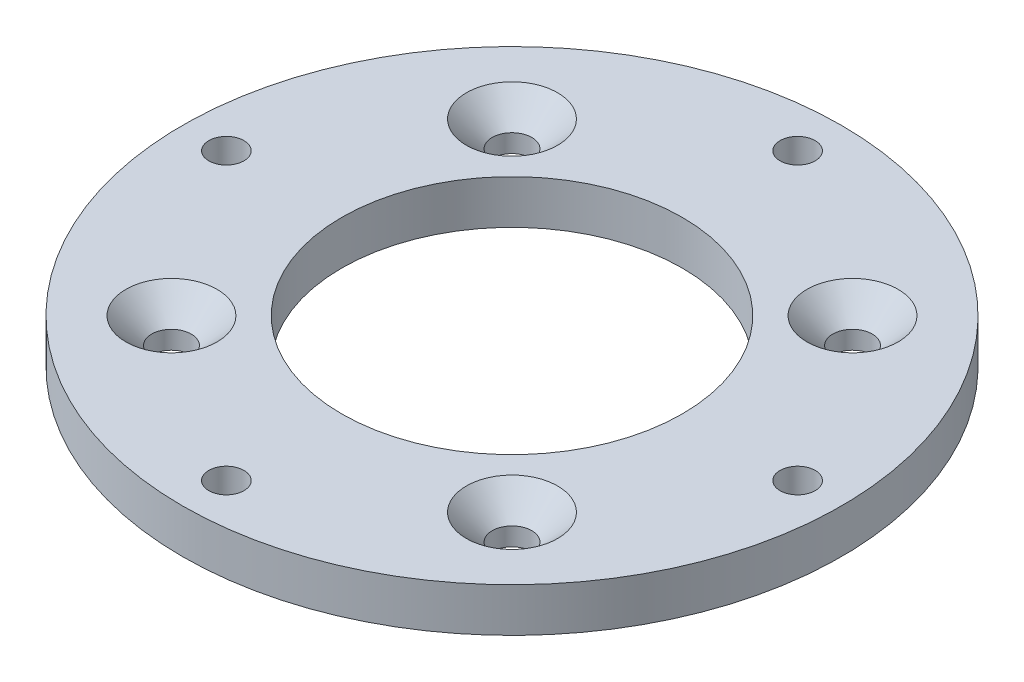
ISO-10303-21;
HEADER;
FILE_DESCRIPTION(('STEP AP214'),'2;1');
FILE_NAME('part.step','',(''),(''),'','','');
FILE_SCHEMA(('AUTOMOTIVE_DESIGN { 1 0 10303 214 1 1 1 1 }'));
ENDSEC;
DATA;
#1=APPLICATION_CONTEXT('core data for automotive mechanical design processes');
#2=APPLICATION_PROTOCOL_DEFINITION('international standard','automotive_design',2000,#1);
#3=PRODUCT_CONTEXT('',#1,'mechanical');
#4=PRODUCT('Part','Part','',(#3));
#5=PRODUCT_RELATED_PRODUCT_CATEGORY('part','',(#4));
#6=PRODUCT_DEFINITION_FORMATION('','',#4);
#7=PRODUCT_DEFINITION_CONTEXT('part definition',#1,'design');
#8=PRODUCT_DEFINITION('design','',#6,#7);
#9=PRODUCT_DEFINITION_SHAPE('','',#8);
#10=(LENGTH_UNIT() NAMED_UNIT(*) SI_UNIT(.MILLI.,.METRE.));
#11=(NAMED_UNIT(*) PLANE_ANGLE_UNIT() SI_UNIT($,.RADIAN.));
#12=(NAMED_UNIT(*) SI_UNIT($,.STERADIAN.) SOLID_ANGLE_UNIT());
#13=UNCERTAINTY_MEASURE_WITH_UNIT(LENGTH_MEASURE(1.E-05),#10,'distance_accuracy_value','');
#14=(GEOMETRIC_REPRESENTATION_CONTEXT(3) GLOBAL_UNCERTAINTY_ASSIGNED_CONTEXT((#13)) GLOBAL_UNIT_ASSIGNED_CONTEXT((#10,
#11,#12)) REPRESENTATION_CONTEXT('',''));
#15=CARTESIAN_POINT('',(0.,0.,0.));
#16=DIRECTION('',(0.,0.,1.));
#17=DIRECTION('',(1.,0.,0.));
#18=AXIS2_PLACEMENT_3D('',#15,#16,#17);
#19=CARTESIAN_POINT('',(0.,-4.,0.));
#20=DIRECTION('',(0.,1.,0.));
#21=DIRECTION('',(0.,0.,1.));
#22=AXIS2_PLACEMENT_3D('',#19,#20,#21);
#23=CYLINDRICAL_SURFACE('',#22,30.);
#24=CARTESIAN_POINT('',(0.,-4.,0.));
#25=DIRECTION('',(0.,1.,0.));
#26=DIRECTION('',(0.,0.,1.));
#27=AXIS2_PLACEMENT_3D('',#24,#25,#26);
#28=CIRCLE('',#27,30.);
#29=CARTESIAN_POINT('',(0.,-4.,30.));
#30=VERTEX_POINT('',#29);
#31=EDGE_CURVE('E10',#30,#30,#28,.T.);
#32=ORIENTED_EDGE('',*,*,#31,.T.);
#33=EDGE_LOOP('',(#32));
#34=FACE_BOUND('',#33,.T.);
#35=CARTESIAN_POINT('',(0.,0.,0.));
#36=DIRECTION('',(0.,1.,0.));
#37=DIRECTION('',(0.,0.,1.));
#38=AXIS2_PLACEMENT_3D('',#35,#36,#37);
#39=CIRCLE('',#38,30.);
#40=CARTESIAN_POINT('',(0.,0.,30.));
#41=VERTEX_POINT('',#40);
#42=EDGE_CURVE('E48',#41,#41,#39,.T.);
#43=ORIENTED_EDGE('',*,*,#42,.F.);
#44=EDGE_LOOP('',(#43));
#45=FACE_BOUND('',#44,.T.);
#46=ADVANCED_FACE('F41',(#34,#45),#23,.T.);
#47=CARTESIAN_POINT('',(0.,-4.,0.));
#48=DIRECTION('',(0.,1.,0.));
#49=DIRECTION('',(0.,0.,1.));
#50=AXIS2_PLACEMENT_3D('',#47,#48,#49);
#51=PLANE('',#50);
#52=CARTESIAN_POINT('',(0.,-4.,26.));
#53=DIRECTION('',(0.,-1.,0.));
#54=DIRECTION('',(0.,0.,-1.));
#55=AXIS2_PLACEMENT_3D('',#52,#53,#54);
#56=CIRCLE('',#55,3.15);
#57=CARTESIAN_POINT('',(0.,-4.,22.85));
#58=VERTEX_POINT('',#57);
#59=EDGE_CURVE('E126',#58,#58,#56,.T.);
#60=ORIENTED_EDGE('',*,*,#59,.F.);
#61=EDGE_LOOP('',(#60));
#62=FACE_BOUND('',#61,.T.);
#63=CARTESIAN_POINT('',(26.,-4.,0.));
#64=DIRECTION('',(0.,-1.,0.));
#65=DIRECTION('',(0.,0.,-1.));
#66=AXIS2_PLACEMENT_3D('',#63,#64,#65);
#67=CIRCLE('',#66,3.15);
#68=CARTESIAN_POINT('',(26.,-4.,-3.15));
#69=VERTEX_POINT('',#68);
#70=EDGE_CURVE('E117',#69,#69,#67,.T.);
#71=ORIENTED_EDGE('',*,*,#70,.F.);
#72=EDGE_LOOP('',(#71));
#73=FACE_BOUND('',#72,.T.);
#74=CARTESIAN_POINT('',(0.,-4.,-26.));
#75=DIRECTION('',(0.,-1.,0.));
#76=DIRECTION('',(0.,0.,-1.));
#77=AXIS2_PLACEMENT_3D('',#74,#75,#76);
#78=CIRCLE('',#77,3.15);
#79=CARTESIAN_POINT('',(0.,-4.,-29.15));
#80=VERTEX_POINT('',#79);
#81=EDGE_CURVE('E108',#80,#80,#78,.T.);
#82=ORIENTED_EDGE('',*,*,#81,.F.);
#83=EDGE_LOOP('',(#82));
#84=FACE_BOUND('',#83,.T.);
#85=CARTESIAN_POINT('',(-26.,-4.,0.));
#86=DIRECTION('',(0.,-1.,0.));
#87=DIRECTION('',(0.,0.,-1.));
#88=AXIS2_PLACEMENT_3D('',#85,#86,#87);
#89=CIRCLE('',#88,3.15);
#90=CARTESIAN_POINT('',(-26.,-4.,-3.15));
#91=VERTEX_POINT('',#90);
#92=EDGE_CURVE('E99',#91,#91,#89,.T.);
#93=ORIENTED_EDGE('',*,*,#92,.F.);
#94=EDGE_LOOP('',(#93));
#95=FACE_BOUND('',#94,.T.);
#96=CARTESIAN_POINT('',(15.5,-4.,-15.5));
#97=DIRECTION('',(0.,1.,0.));
#98=DIRECTION('',(0.,0.,1.));
#99=AXIS2_PLACEMENT_3D('',#96,#97,#98);
#100=CIRCLE('',#99,1.8);
#101=CARTESIAN_POINT('',(15.5,-4.,-13.7));
#102=VERTEX_POINT('',#101);
#103=EDGE_CURVE('E84',#102,#102,#100,.T.);
#104=ORIENTED_EDGE('',*,*,#103,.T.);
#105=EDGE_LOOP('',(#104));
#106=FACE_BOUND('',#105,.T.);
#107=CARTESIAN_POINT('',(-15.5,-4.,-15.5));
#108=DIRECTION('',(0.,1.,0.));
#109=DIRECTION('',(0.,0.,1.));
#110=AXIS2_PLACEMENT_3D('',#107,#108,#109);
#111=CIRCLE('',#110,1.8);
#112=CARTESIAN_POINT('',(-15.5,-4.,-13.7));
#113=VERTEX_POINT('',#112);
#114=EDGE_CURVE('E75',#113,#113,#111,.T.);
#115=ORIENTED_EDGE('',*,*,#114,.T.);
#116=EDGE_LOOP('',(#115));
#117=FACE_BOUND('',#116,.T.);
#118=CARTESIAN_POINT('',(-15.5,-4.,15.5));
#119=DIRECTION('',(0.,1.,0.));
#120=DIRECTION('',(0.,0.,1.));
#121=AXIS2_PLACEMENT_3D('',#118,#119,#120);
#122=CIRCLE('',#121,1.8);
#123=CARTESIAN_POINT('',(-15.5,-4.,17.3));
#124=VERTEX_POINT('',#123);
#125=EDGE_CURVE('E66',#124,#124,#122,.T.);
#126=ORIENTED_EDGE('',*,*,#125,.T.);
#127=EDGE_LOOP('',(#126));
#128=FACE_BOUND('',#127,.T.);
#129=CARTESIAN_POINT('',(15.5,-4.,15.5));
#130=DIRECTION('',(0.,1.,0.));
#131=DIRECTION('',(0.,0.,1.));
#132=AXIS2_PLACEMENT_3D('',#129,#130,#131);
#133=CIRCLE('',#132,1.8);
#134=CARTESIAN_POINT('',(15.5,-4.,17.3));
#135=VERTEX_POINT('',#134);
#136=EDGE_CURVE('E57',#135,#135,#133,.T.);
#137=ORIENTED_EDGE('',*,*,#136,.T.);
#138=EDGE_LOOP('',(#137));
#139=FACE_BOUND('',#138,.T.);
#140=CARTESIAN_POINT('',(0.,-4.,0.));
#141=DIRECTION('',(0.,-1.,0.));
#142=DIRECTION('',(0.,0.,-1.));
#143=AXIS2_PLACEMENT_3D('',#140,#141,#142);
#144=CIRCLE('',#143,15.5);
#145=CARTESIAN_POINT('',(0.,-4.,-15.5));
#146=VERTEX_POINT('',#145);
#147=EDGE_CURVE('E54',#146,#146,#144,.T.);
#148=ORIENTED_EDGE('',*,*,#147,.F.);
#149=EDGE_LOOP('',(#148));
#150=FACE_BOUND('',#149,.T.);
#151=ORIENTED_EDGE('',*,*,#31,.F.);
#152=EDGE_LOOP('',(#151));
#153=FACE_BOUND('',#152,.T.);
#154=ADVANCED_FACE('F132',(#62,#73,#84,#95,#106,#117,#128,#139,#150,#153),#51,.F.);
#155=CARTESIAN_POINT('',(0.,0.,0.));
#156=DIRECTION('',(0.,1.,0.));
#157=DIRECTION('',(0.,0.,1.));
#158=AXIS2_PLACEMENT_3D('',#155,#156,#157);
#159=PLANE('',#158);
#160=CARTESIAN_POINT('',(0.,0.,26.));
#161=DIRECTION('',(0.,-1.,0.));
#162=DIRECTION('',(0.,0.,-1.));
#163=AXIS2_PLACEMENT_3D('',#160,#161,#162);
#164=CIRCLE('',#163,1.6);
#165=CARTESIAN_POINT('',(0.,0.,24.4));
#166=VERTEX_POINT('',#165);
#167=EDGE_CURVE('E120',#166,#166,#164,.T.);
#168=ORIENTED_EDGE('',*,*,#167,.T.);
#169=EDGE_LOOP('',(#168));
#170=FACE_BOUND('',#169,.T.);
#171=CARTESIAN_POINT('',(26.,0.,0.));
#172=DIRECTION('',(0.,-1.,0.));
#173=DIRECTION('',(0.,0.,-1.));
#174=AXIS2_PLACEMENT_3D('',#171,#172,#173);
#175=CIRCLE('',#174,1.6);
#176=CARTESIAN_POINT('',(26.,0.,-1.6));
#177=VERTEX_POINT('',#176);
#178=EDGE_CURVE('E111',#177,#177,#175,.T.);
#179=ORIENTED_EDGE('',*,*,#178,.T.);
#180=EDGE_LOOP('',(#179));
#181=FACE_BOUND('',#180,.T.);
#182=CARTESIAN_POINT('',(0.,0.,-26.));
#183=DIRECTION('',(0.,-1.,0.));
#184=DIRECTION('',(0.,0.,-1.));
#185=AXIS2_PLACEMENT_3D('',#182,#183,#184);
#186=CIRCLE('',#185,1.6);
#187=CARTESIAN_POINT('',(0.,0.,-27.6));
#188=VERTEX_POINT('',#187);
#189=EDGE_CURVE('E102',#188,#188,#186,.T.);
#190=ORIENTED_EDGE('',*,*,#189,.T.);
#191=EDGE_LOOP('',(#190));
#192=FACE_BOUND('',#191,.T.);
#193=CARTESIAN_POINT('',(-26.,0.,0.));
#194=DIRECTION('',(0.,-1.,0.));
#195=DIRECTION('',(0.,0.,-1.));
#196=AXIS2_PLACEMENT_3D('',#193,#194,#195);
#197=CIRCLE('',#196,1.6);
#198=CARTESIAN_POINT('',(-26.,0.,-1.6));
#199=VERTEX_POINT('',#198);
#200=EDGE_CURVE('E93',#199,#199,#197,.T.);
#201=ORIENTED_EDGE('',*,*,#200,.T.);
#202=EDGE_LOOP('',(#201));
#203=FACE_BOUND('',#202,.T.);
#204=CARTESIAN_POINT('',(15.5,0.,-15.5));
#205=DIRECTION('',(0.,1.,0.));
#206=DIRECTION('',(0.,0.,1.));
#207=AXIS2_PLACEMENT_3D('',#204,#205,#206);
#208=CIRCLE('',#207,4.15);
#209=CARTESIAN_POINT('',(15.5,0.,-11.35));
#210=VERTEX_POINT('',#209);
#211=EDGE_CURVE('E90',#210,#210,#208,.T.);
#212=ORIENTED_EDGE('',*,*,#211,.F.);
#213=EDGE_LOOP('',(#212));
#214=FACE_BOUND('',#213,.T.);
#215=CARTESIAN_POINT('',(-15.5,0.,-15.5));
#216=DIRECTION('',(0.,1.,0.));
#217=DIRECTION('',(0.,0.,1.));
#218=AXIS2_PLACEMENT_3D('',#215,#216,#217);
#219=CIRCLE('',#218,4.15);
#220=CARTESIAN_POINT('',(-15.5,0.,-11.35));
#221=VERTEX_POINT('',#220);
#222=EDGE_CURVE('E81',#221,#221,#219,.T.);
#223=ORIENTED_EDGE('',*,*,#222,.F.);
#224=EDGE_LOOP('',(#223));
#225=FACE_BOUND('',#224,.T.);
#226=CARTESIAN_POINT('',(-15.5,0.,15.5));
#227=DIRECTION('',(0.,1.,0.));
#228=DIRECTION('',(0.,0.,1.));
#229=AXIS2_PLACEMENT_3D('',#226,#227,#228);
#230=CIRCLE('',#229,4.15);
#231=CARTESIAN_POINT('',(-15.5,0.,19.65));
#232=VERTEX_POINT('',#231);
#233=EDGE_CURVE('E72',#232,#232,#230,.T.);
#234=ORIENTED_EDGE('',*,*,#233,.F.);
#235=EDGE_LOOP('',(#234));
#236=FACE_BOUND('',#235,.T.);
#237=CARTESIAN_POINT('',(15.5,0.,15.5));
#238=DIRECTION('',(0.,1.,0.));
#239=DIRECTION('',(0.,0.,1.));
#240=AXIS2_PLACEMENT_3D('',#237,#238,#239);
#241=CIRCLE('',#240,4.15);
#242=CARTESIAN_POINT('',(15.5,0.,19.65));
#243=VERTEX_POINT('',#242);
#244=EDGE_CURVE('E63',#243,#243,#241,.T.);
#245=ORIENTED_EDGE('',*,*,#244,.F.);
#246=EDGE_LOOP('',(#245));
#247=FACE_BOUND('',#246,.T.);
#248=CARTESIAN_POINT('',(0.,0.,0.));
#249=DIRECTION('',(0.,1.,0.));
#250=DIRECTION('',(0.,0.,1.));
#251=AXIS2_PLACEMENT_3D('',#248,#249,#250);
#252=CIRCLE('',#251,15.5);
#253=CARTESIAN_POINT('',(0.,0.,15.5));
#254=VERTEX_POINT('',#253);
#255=EDGE_CURVE('E44',#254,#254,#252,.T.);
#256=ORIENTED_EDGE('',*,*,#255,.F.);
#257=EDGE_LOOP('',(#256));
#258=FACE_BOUND('',#257,.T.);
#259=ORIENTED_EDGE('',*,*,#42,.T.);
#260=EDGE_LOOP('',(#259));
#261=FACE_BOUND('',#260,.T.);
#262=ADVANCED_FACE('F135',(#170,#181,#192,#203,#214,#225,#236,#247,#258,#261),#159,.T.);
#263=CARTESIAN_POINT('',(0.,2.,0.));
#264=DIRECTION('',(0.,-1.,0.));
#265=DIRECTION('',(0.,0.,-1.));
#266=AXIS2_PLACEMENT_3D('',#263,#264,#265);
#267=CYLINDRICAL_SURFACE('',#266,15.5);
#268=ORIENTED_EDGE('',*,*,#255,.T.);
#269=EDGE_LOOP('',(#268));
#270=FACE_BOUND('',#269,.T.);
#271=ORIENTED_EDGE('',*,*,#147,.T.);
#272=EDGE_LOOP('',(#271));
#273=FACE_BOUND('',#272,.T.);
#274=ADVANCED_FACE('F154',(#270,#273),#267,.F.);
#275=CARTESIAN_POINT('',(15.5,0.,15.5));
#276=DIRECTION('',(0.,1.,0.));
#277=DIRECTION('',(0.,0.,1.));
#278=AXIS2_PLACEMENT_3D('',#275,#276,#277);
#279=CYLINDRICAL_SURFACE('',#278,1.8);
#280=ORIENTED_EDGE('',*,*,#136,.F.);
#281=EDGE_LOOP('',(#280));
#282=FACE_BOUND('',#281,.T.);
#283=CARTESIAN_POINT('',(15.5,-2.35,15.5));
#284=DIRECTION('',(0.,1.,0.));
#285=DIRECTION('',(0.,0.,1.));
#286=AXIS2_PLACEMENT_3D('',#283,#284,#285);
#287=CIRCLE('',#286,1.8);
#288=CARTESIAN_POINT('',(15.5,-2.35,17.3));
#289=VERTEX_POINT('',#288);
#290=EDGE_CURVE('E60',#289,#289,#287,.T.);
#291=ORIENTED_EDGE('',*,*,#290,.T.);
#292=EDGE_LOOP('',(#291));
#293=FACE_BOUND('',#292,.T.);
#294=ADVANCED_FACE('F156',(#282,#293),#279,.F.);
#295=CARTESIAN_POINT('',(15.5,0.,15.5));
#296=DIRECTION('',(0.,1.,0.));
#297=DIRECTION('',(0.,0.,1.));
#298=AXIS2_PLACEMENT_3D('',#295,#296,#297);
#299=CONICAL_SURFACE('',#298,4.15,0.785398163397448);
#300=ORIENTED_EDGE('',*,*,#290,.F.);
#301=EDGE_LOOP('',(#300));
#302=FACE_BOUND('',#301,.T.);
#303=ORIENTED_EDGE('',*,*,#244,.T.);
#304=EDGE_LOOP('',(#303));
#305=FACE_BOUND('',#304,.T.);
#306=ADVANCED_FACE('F163',(#302,#305),#299,.F.);
#307=CARTESIAN_POINT('',(-15.5,0.,15.5));
#308=DIRECTION('',(0.,1.,0.));
#309=DIRECTION('',(0.,0.,1.));
#310=AXIS2_PLACEMENT_3D('',#307,#308,#309);
#311=CYLINDRICAL_SURFACE('',#310,1.8);
#312=ORIENTED_EDGE('',*,*,#125,.F.);
#313=EDGE_LOOP('',(#312));
#314=FACE_BOUND('',#313,.T.);
#315=CARTESIAN_POINT('',(-15.5,-2.35,15.5));
#316=DIRECTION('',(0.,1.,0.));
#317=DIRECTION('',(0.,0.,1.));
#318=AXIS2_PLACEMENT_3D('',#315,#316,#317);
#319=CIRCLE('',#318,1.8);
#320=CARTESIAN_POINT('',(-15.5,-2.35,17.3));
#321=VERTEX_POINT('',#320);
#322=EDGE_CURVE('E69',#321,#321,#319,.T.);
#323=ORIENTED_EDGE('',*,*,#322,.T.);
#324=EDGE_LOOP('',(#323));
#325=FACE_BOUND('',#324,.T.);
#326=ADVANCED_FACE('F208',(#314,#325),#311,.F.);
#327=CARTESIAN_POINT('',(-15.5,0.,15.5));
#328=DIRECTION('',(0.,1.,0.));
#329=DIRECTION('',(0.,0.,1.));
#330=AXIS2_PLACEMENT_3D('',#327,#328,#329);
#331=CONICAL_SURFACE('',#330,4.15,0.785398163397448);
#332=ORIENTED_EDGE('',*,*,#322,.F.);
#333=EDGE_LOOP('',(#332));
#334=FACE_BOUND('',#333,.T.);
#335=ORIENTED_EDGE('',*,*,#233,.T.);
#336=EDGE_LOOP('',(#335));
#337=FACE_BOUND('',#336,.T.);
#338=ADVANCED_FACE('F219',(#334,#337),#331,.F.);
#339=CARTESIAN_POINT('',(-15.5,0.,-15.5));
#340=DIRECTION('',(0.,1.,0.));
#341=DIRECTION('',(0.,0.,1.));
#342=AXIS2_PLACEMENT_3D('',#339,#340,#341);
#343=CYLINDRICAL_SURFACE('',#342,1.8);
#344=ORIENTED_EDGE('',*,*,#114,.F.);
#345=EDGE_LOOP('',(#344));
#346=FACE_BOUND('',#345,.T.);
#347=CARTESIAN_POINT('',(-15.5,-2.35,-15.5));
#348=DIRECTION('',(0.,1.,0.));
#349=DIRECTION('',(0.,0.,1.));
#350=AXIS2_PLACEMENT_3D('',#347,#348,#349);
#351=CIRCLE('',#350,1.8);
#352=CARTESIAN_POINT('',(-15.5,-2.35,-13.7));
#353=VERTEX_POINT('',#352);
#354=EDGE_CURVE('E78',#353,#353,#351,.T.);
#355=ORIENTED_EDGE('',*,*,#354,.T.);
#356=EDGE_LOOP('',(#355));
#357=FACE_BOUND('',#356,.T.);
#358=ADVANCED_FACE('F230',(#346,#357),#343,.F.);
#359=CARTESIAN_POINT('',(-15.5,0.,-15.5));
#360=DIRECTION('',(0.,1.,0.));
#361=DIRECTION('',(0.,0.,1.));
#362=AXIS2_PLACEMENT_3D('',#359,#360,#361);
#363=CONICAL_SURFACE('',#362,4.15,0.785398163397448);
#364=ORIENTED_EDGE('',*,*,#354,.F.);
#365=EDGE_LOOP('',(#364));
#366=FACE_BOUND('',#365,.T.);
#367=ORIENTED_EDGE('',*,*,#222,.T.);
#368=EDGE_LOOP('',(#367));
#369=FACE_BOUND('',#368,.T.);
#370=ADVANCED_FACE('F241',(#366,#369),#363,.F.);
#371=CARTESIAN_POINT('',(15.5,0.,-15.5));
#372=DIRECTION('',(0.,1.,0.));
#373=DIRECTION('',(0.,0.,1.));
#374=AXIS2_PLACEMENT_3D('',#371,#372,#373);
#375=CYLINDRICAL_SURFACE('',#374,1.8);
#376=ORIENTED_EDGE('',*,*,#103,.F.);
#377=EDGE_LOOP('',(#376));
#378=FACE_BOUND('',#377,.T.);
#379=CARTESIAN_POINT('',(15.5,-2.35,-15.5));
#380=DIRECTION('',(0.,1.,0.));
#381=DIRECTION('',(0.,0.,1.));
#382=AXIS2_PLACEMENT_3D('',#379,#380,#381);
#383=CIRCLE('',#382,1.8);
#384=CARTESIAN_POINT('',(15.5,-2.35,-13.7));
#385=VERTEX_POINT('',#384);
#386=EDGE_CURVE('E87',#385,#385,#383,.T.);
#387=ORIENTED_EDGE('',*,*,#386,.T.);
#388=EDGE_LOOP('',(#387));
#389=FACE_BOUND('',#388,.T.);
#390=ADVANCED_FACE('F252',(#378,#389),#375,.F.);
#391=CARTESIAN_POINT('',(15.5,0.,-15.5));
#392=DIRECTION('',(0.,1.,0.));
#393=DIRECTION('',(0.,0.,1.));
#394=AXIS2_PLACEMENT_3D('',#391,#392,#393);
#395=CONICAL_SURFACE('',#394,4.15,0.785398163397448);
#396=ORIENTED_EDGE('',*,*,#386,.F.);
#397=EDGE_LOOP('',(#396));
#398=FACE_BOUND('',#397,.T.);
#399=ORIENTED_EDGE('',*,*,#211,.T.);
#400=EDGE_LOOP('',(#399));
#401=FACE_BOUND('',#400,.T.);
#402=ADVANCED_FACE('F263',(#398,#401),#395,.F.);
#403=CARTESIAN_POINT('',(-26.,-4.,0.));
#404=DIRECTION('',(0.,-1.,0.));
#405=DIRECTION('',(0.,0.,-1.));
#406=AXIS2_PLACEMENT_3D('',#403,#404,#405);
#407=CYLINDRICAL_SURFACE('',#406,1.6);
#408=ORIENTED_EDGE('',*,*,#200,.F.);
#409=EDGE_LOOP('',(#408));
#410=FACE_BOUND('',#409,.T.);
#411=CARTESIAN_POINT('',(-26.,-2.45,0.));
#412=DIRECTION('',(0.,-1.,0.));
#413=DIRECTION('',(0.,0.,-1.));
#414=AXIS2_PLACEMENT_3D('',#411,#412,#413);
#415=CIRCLE('',#414,1.6);
#416=CARTESIAN_POINT('',(-26.,-2.45,-1.6));
#417=VERTEX_POINT('',#416);
#418=EDGE_CURVE('E96',#417,#417,#415,.T.);
#419=ORIENTED_EDGE('',*,*,#418,.T.);
#420=EDGE_LOOP('',(#419));
#421=FACE_BOUND('',#420,.T.);
#422=ADVANCED_FACE('F273',(#410,#421),#407,.F.);
#423=CARTESIAN_POINT('',(-26.,-4.,0.));
#424=DIRECTION('',(0.,-1.,0.));
#425=DIRECTION('',(0.,0.,-1.));
#426=AXIS2_PLACEMENT_3D('',#423,#424,#425);
#427=CONICAL_SURFACE('',#426,3.15,0.785398163397448);
#428=ORIENTED_EDGE('',*,*,#418,.F.);
#429=EDGE_LOOP('',(#428));
#430=FACE_BOUND('',#429,.T.);
#431=ORIENTED_EDGE('',*,*,#92,.T.);
#432=EDGE_LOOP('',(#431));
#433=FACE_BOUND('',#432,.T.);
#434=ADVANCED_FACE('F307',(#430,#433),#427,.F.);
#435=CARTESIAN_POINT('',(0.,-4.,-26.));
#436=DIRECTION('',(0.,-1.,0.));
#437=DIRECTION('',(0.,0.,-1.));
#438=AXIS2_PLACEMENT_3D('',#435,#436,#437);
#439=CYLINDRICAL_SURFACE('',#438,1.6);
#440=ORIENTED_EDGE('',*,*,#189,.F.);
#441=EDGE_LOOP('',(#440));
#442=FACE_BOUND('',#441,.T.);
#443=CARTESIAN_POINT('',(0.,-2.45,-26.));
#444=DIRECTION('',(0.,-1.,0.));
#445=DIRECTION('',(0.,0.,-1.));
#446=AXIS2_PLACEMENT_3D('',#443,#444,#445);
#447=CIRCLE('',#446,1.6);
#448=CARTESIAN_POINT('',(0.,-2.45,-27.6));
#449=VERTEX_POINT('',#448);
#450=EDGE_CURVE('E105',#449,#449,#447,.T.);
#451=ORIENTED_EDGE('',*,*,#450,.T.);
#452=EDGE_LOOP('',(#451));
#453=FACE_BOUND('',#452,.T.);
#454=ADVANCED_FACE('F316',(#442,#453),#439,.F.);
#455=CARTESIAN_POINT('',(0.,-4.,-26.));
#456=DIRECTION('',(0.,-1.,0.));
#457=DIRECTION('',(0.,0.,-1.));
#458=AXIS2_PLACEMENT_3D('',#455,#456,#457);
#459=CONICAL_SURFACE('',#458,3.15,0.785398163397449);
#460=ORIENTED_EDGE('',*,*,#450,.F.);
#461=EDGE_LOOP('',(#460));
#462=FACE_BOUND('',#461,.T.);
#463=ORIENTED_EDGE('',*,*,#81,.T.);
#464=EDGE_LOOP('',(#463));
#465=FACE_BOUND('',#464,.T.);
#466=ADVANCED_FACE('F326',(#462,#465),#459,.F.);
#467=CARTESIAN_POINT('',(26.,-4.,0.));
#468=DIRECTION('',(0.,-1.,0.));
#469=DIRECTION('',(0.,0.,-1.));
#470=AXIS2_PLACEMENT_3D('',#467,#468,#469);
#471=CYLINDRICAL_SURFACE('',#470,1.6);
#472=ORIENTED_EDGE('',*,*,#178,.F.);
#473=EDGE_LOOP('',(#472));
#474=FACE_BOUND('',#473,.T.);
#475=CARTESIAN_POINT('',(26.,-2.45,0.));
#476=DIRECTION('',(0.,-1.,0.));
#477=DIRECTION('',(0.,0.,-1.));
#478=AXIS2_PLACEMENT_3D('',#475,#476,#477);
#479=CIRCLE('',#478,1.6);
#480=CARTESIAN_POINT('',(26.,-2.45,-1.6));
#481=VERTEX_POINT('',#480);
#482=EDGE_CURVE('E114',#481,#481,#479,.T.);
#483=ORIENTED_EDGE('',*,*,#482,.T.);
#484=EDGE_LOOP('',(#483));
#485=FACE_BOUND('',#484,.T.);
#486=ADVANCED_FACE('F336',(#474,#485),#471,.F.);
#487=CARTESIAN_POINT('',(26.,-4.,0.));
#488=DIRECTION('',(0.,-1.,0.));
#489=DIRECTION('',(0.,0.,-1.));
#490=AXIS2_PLACEMENT_3D('',#487,#488,#489);
#491=CONICAL_SURFACE('',#490,3.15,0.785398163397448);
#492=ORIENTED_EDGE('',*,*,#482,.F.);
#493=EDGE_LOOP('',(#492));
#494=FACE_BOUND('',#493,.T.);
#495=ORIENTED_EDGE('',*,*,#70,.T.);
#496=EDGE_LOOP('',(#495));
#497=FACE_BOUND('',#496,.T.);
#498=ADVANCED_FACE('F346',(#494,#497),#491,.F.);
#499=CARTESIAN_POINT('',(0.,-4.,26.));
#500=DIRECTION('',(0.,-1.,0.));
#501=DIRECTION('',(0.,0.,-1.));
#502=AXIS2_PLACEMENT_3D('',#499,#500,#501);
#503=CYLINDRICAL_SURFACE('',#502,1.6);
#504=ORIENTED_EDGE('',*,*,#167,.F.);
#505=EDGE_LOOP('',(#504));
#506=FACE_BOUND('',#505,.T.);
#507=CARTESIAN_POINT('',(0.,-2.45,26.));
#508=DIRECTION('',(0.,-1.,0.));
#509=DIRECTION('',(0.,0.,-1.));
#510=AXIS2_PLACEMENT_3D('',#507,#508,#509);
#511=CIRCLE('',#510,1.6);
#512=CARTESIAN_POINT('',(0.,-2.45,24.4));
#513=VERTEX_POINT('',#512);
#514=EDGE_CURVE('E123',#513,#513,#511,.T.);
#515=ORIENTED_EDGE('',*,*,#514,.T.);
#516=EDGE_LOOP('',(#515));
#517=FACE_BOUND('',#516,.T.);
#518=ADVANCED_FACE('F356',(#506,#517),#503,.F.);
#519=CARTESIAN_POINT('',(0.,-4.,26.));
#520=DIRECTION('',(0.,-1.,0.));
#521=DIRECTION('',(0.,0.,-1.));
#522=AXIS2_PLACEMENT_3D('',#519,#520,#521);
#523=CONICAL_SURFACE('',#522,3.15,0.785398163397449);
#524=ORIENTED_EDGE('',*,*,#514,.F.);
#525=EDGE_LOOP('',(#524));
#526=FACE_BOUND('',#525,.T.);
#527=ORIENTED_EDGE('',*,*,#59,.T.);
#528=EDGE_LOOP('',(#527));
#529=FACE_BOUND('',#528,.T.);
#530=ADVANCED_FACE('F130',(#526,#529),#523,.F.);
#531=CLOSED_SHELL('',(#46,#154,#262,#274,#294,#306,#326,#338,#358,#370,#390,#402,#422,#434,#454,
#466,#486,#498,#518,#530));
#532=MANIFOLD_SOLID_BREP('B2',#531);
#533=ADVANCED_BREP_SHAPE_REPRESENTATION('',(#18,#532),#14);
#534=SHAPE_DEFINITION_REPRESENTATION(#9,#533);
ENDSEC;
END-ISO-10303-21;
